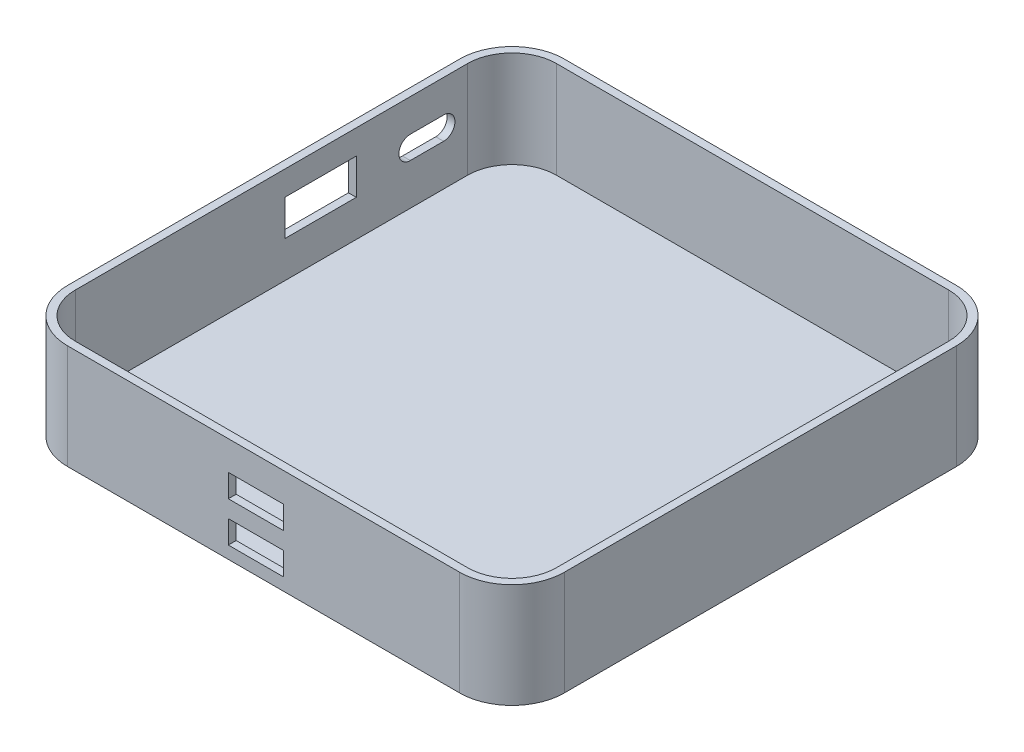
ISO-10303-21;
HEADER;
FILE_DESCRIPTION(('STEP AP214'),'2;1');
FILE_NAME('part.step','',(''),(''),'','','');
FILE_SCHEMA(('AUTOMOTIVE_DESIGN { 1 0 10303 214 1 1 1 1 }'));
ENDSEC;
DATA;
#1=APPLICATION_CONTEXT('core data for automotive mechanical design processes');
#2=APPLICATION_PROTOCOL_DEFINITION('international standard','automotive_design',2000,#1);
#3=PRODUCT_CONTEXT('',#1,'mechanical');
#4=PRODUCT('Part','Part','',(#3));
#5=PRODUCT_RELATED_PRODUCT_CATEGORY('part','',(#4));
#6=PRODUCT_DEFINITION_FORMATION('','',#4);
#7=PRODUCT_DEFINITION_CONTEXT('part definition',#1,'design');
#8=PRODUCT_DEFINITION('design','',#6,#7);
#9=PRODUCT_DEFINITION_SHAPE('','',#8);
#10=(LENGTH_UNIT() NAMED_UNIT(*) SI_UNIT(.MILLI.,.METRE.));
#11=(NAMED_UNIT(*) PLANE_ANGLE_UNIT() SI_UNIT($,.RADIAN.));
#12=(NAMED_UNIT(*) SI_UNIT($,.STERADIAN.) SOLID_ANGLE_UNIT());
#13=UNCERTAINTY_MEASURE_WITH_UNIT(LENGTH_MEASURE(1.E-05),#10,'distance_accuracy_value','');
#14=(GEOMETRIC_REPRESENTATION_CONTEXT(3) GLOBAL_UNCERTAINTY_ASSIGNED_CONTEXT((#13)) GLOBAL_UNIT_ASSIGNED_CONTEXT((#10,
#11,#12)) REPRESENTATION_CONTEXT('',''));
#15=CARTESIAN_POINT('',(0.,0.,0.));
#16=DIRECTION('',(0.,0.,1.));
#17=DIRECTION('',(1.,0.,0.));
#18=AXIS2_PLACEMENT_3D('',#15,#16,#17);
#19=CARTESIAN_POINT('',(47.5,20.,-47.5));
#20=DIRECTION('',(-1.,0.,0.));
#21=DIRECTION('',(0.,0.,1.));
#22=AXIS2_PLACEMENT_3D('',#19,#20,#21);
#23=PLANE('',#22);
#24=DIRECTION('',(0.,0.,-1.));
#25=VECTOR('',#24,1.);
#26=CARTESIAN_POINT('',(47.5,0.,-47.5));
#27=LINE('',#26,#25);
#28=CARTESIAN_POINT('',(47.5,0.,37.5));
#29=VERTEX_POINT('',#28);
#30=CARTESIAN_POINT('',(47.5,0.,-37.5));
#31=VERTEX_POINT('',#30);
#32=EDGE_CURVE('E383',#29,#31,#27,.T.);
#33=ORIENTED_EDGE('',*,*,#32,.T.);
#34=DIRECTION('',(0.,-1.,0.));
#35=VECTOR('',#34,1.);
#36=CARTESIAN_POINT('',(47.5,20.,-37.5));
#37=LINE('',#36,#35);
#38=CARTESIAN_POINT('',(47.5,20.,-37.5));
#39=VERTEX_POINT('',#38);
#40=EDGE_CURVE('E455',#31,#39,#37,.F.);
#41=ORIENTED_EDGE('',*,*,#40,.T.);
#42=DIRECTION('',(0.,0.,-1.));
#43=VECTOR('',#42,1.);
#44=CARTESIAN_POINT('',(47.5,20.,-47.5));
#45=LINE('',#44,#43);
#46=CARTESIAN_POINT('',(47.5,20.,37.5));
#47=VERTEX_POINT('',#46);
#48=EDGE_CURVE('E398',#47,#39,#45,.T.);
#49=ORIENTED_EDGE('',*,*,#48,.F.);
#50=DIRECTION('',(0.,-1.,0.));
#51=VECTOR('',#50,1.);
#52=CARTESIAN_POINT('',(47.5,20.,37.5));
#53=LINE('',#52,#51);
#54=EDGE_CURVE('E452',#47,#29,#53,.T.);
#55=ORIENTED_EDGE('',*,*,#54,.T.);
#56=EDGE_LOOP('',(#33,#41,#49,#55));
#57=FACE_BOUND('',#56,.T.);
#58=ADVANCED_FACE('F33',(#57),#23,.F.);
#59=CARTESIAN_POINT('',(-47.5,20.,-47.5));
#60=DIRECTION('',(0.,0.,1.));
#61=DIRECTION('',(1.,0.,0.));
#62=AXIS2_PLACEMENT_3D('',#59,#60,#61);
#63=PLANE('',#62);
#64=DIRECTION('',(-1.,0.,0.));
#65=VECTOR('',#64,1.);
#66=CARTESIAN_POINT('',(-47.5,0.,-47.5));
#67=LINE('',#66,#65);
#68=CARTESIAN_POINT('',(37.5,0.,-47.5));
#69=VERTEX_POINT('',#68);
#70=CARTESIAN_POINT('',(-37.5,0.,-47.5));
#71=VERTEX_POINT('',#70);
#72=EDGE_CURVE('E414',#69,#71,#67,.T.);
#73=ORIENTED_EDGE('',*,*,#72,.T.);
#74=DIRECTION('',(0.,-1.,0.));
#75=VECTOR('',#74,1.);
#76=CARTESIAN_POINT('',(-37.5,20.,-47.5));
#77=LINE('',#76,#75);
#78=CARTESIAN_POINT('',(-37.5,20.,-47.5));
#79=VERTEX_POINT('',#78);
#80=EDGE_CURVE('E437',#71,#79,#77,.F.);
#81=ORIENTED_EDGE('',*,*,#80,.T.);
#82=DIRECTION('',(-1.,0.,0.));
#83=VECTOR('',#82,1.);
#84=CARTESIAN_POINT('',(-47.5,20.,-47.5));
#85=LINE('',#84,#83);
#86=CARTESIAN_POINT('',(37.5,20.,-47.5));
#87=VERTEX_POINT('',#86);
#88=EDGE_CURVE('E401',#87,#79,#85,.T.);
#89=ORIENTED_EDGE('',*,*,#88,.F.);
#90=DIRECTION('',(0.,-1.,0.));
#91=VECTOR('',#90,1.);
#92=CARTESIAN_POINT('',(37.5,20.,-47.5));
#93=LINE('',#92,#91);
#94=EDGE_CURVE('E434',#87,#69,#93,.T.);
#95=ORIENTED_EDGE('',*,*,#94,.T.);
#96=EDGE_LOOP('',(#73,#81,#89,#95));
#97=FACE_BOUND('',#96,.T.);
#98=ADVANCED_FACE('F517',(#97),#63,.F.);
#99=CARTESIAN_POINT('',(-47.5,20.,-47.5));
#100=DIRECTION('',(1.,0.,0.));
#101=DIRECTION('',(0.,0.,-1.));
#102=AXIS2_PLACEMENT_3D('',#99,#100,#101);
#103=PLANE('',#102);
#104=DIRECTION('',(0.,0.,-1.));
#105=VECTOR('',#104,1.);
#106=CARTESIAN_POINT('',(-47.5,15.3170391811273,-16.2201304270935));
#107=LINE('',#106,#105);
#108=CARTESIAN_POINT('',(-47.5,15.3170391811273,-2.59894898769258));
#109=VERTEX_POINT('',#108);
#110=CARTESIAN_POINT('',(-47.5,15.3170391811273,-16.2201304270935));
#111=VERTEX_POINT('',#110);
#112=EDGE_CURVE('E295',#109,#111,#107,.T.);
#113=ORIENTED_EDGE('',*,*,#112,.F.);
#114=DIRECTION('',(0.,1.,0.));
#115=VECTOR('',#114,1.);
#116=CARTESIAN_POINT('',(-47.5,8.48168902621182,-2.59894898769258));
#117=LINE('',#116,#115);
#118=CARTESIAN_POINT('',(-47.5,8.48168902621182,-2.59894898769258));
#119=VERTEX_POINT('',#118);
#120=EDGE_CURVE('E273',#119,#109,#117,.T.);
#121=ORIENTED_EDGE('',*,*,#120,.F.);
#122=DIRECTION('',(0.,0.,1.));
#123=VECTOR('',#122,1.);
#124=CARTESIAN_POINT('',(-47.5,8.48168902621182,-16.2201304270935));
#125=LINE('',#124,#123);
#126=CARTESIAN_POINT('',(-47.5,8.48168902621182,-16.2201304270935));
#127=VERTEX_POINT('',#126);
#128=EDGE_CURVE('E301',#127,#119,#125,.T.);
#129=ORIENTED_EDGE('',*,*,#128,.F.);
#130=DIRECTION('',(0.,-1.,0.));
#131=VECTOR('',#130,1.);
#132=CARTESIAN_POINT('',(-47.5,8.48168902621182,-16.2201304270935));
#133=LINE('',#132,#131);
#134=EDGE_CURVE('E298',#111,#127,#133,.T.);
#135=ORIENTED_EDGE('',*,*,#134,.F.);
#136=EDGE_LOOP('',(#113,#121,#129,#135));
#137=FACE_BOUND('',#136,.T.);
#138=DIRECTION('',(0.,0.,1.));
#139=VECTOR('',#138,1.);
#140=CARTESIAN_POINT('',(-47.5,9.41378222927369,-32.917062514101));
#141=LINE('',#140,#139);
#142=CARTESIAN_POINT('',(-47.5,9.41378222927369,-32.917062514101));
#143=VERTEX_POINT('',#142);
#144=CARTESIAN_POINT('',(-47.5,9.41378222927369,-26.5458647440587));
#145=VERTEX_POINT('',#144);
#146=EDGE_CURVE('E315',#143,#145,#141,.T.);
#147=ORIENTED_EDGE('',*,*,#146,.F.);
#148=CARTESIAN_POINT('',(-47.5,11.5886663693914,-32.917062514101));
#149=DIRECTION('',(-1.,0.,0.));
#150=DIRECTION('',(0.,0.,1.));
#151=AXIS2_PLACEMENT_3D('',#148,#149,#150);
#152=CIRCLE('',#151,2.17488414011768);
#153=CARTESIAN_POINT('',(-47.5,13.7635505095091,-32.917062514101));
#154=VERTEX_POINT('',#153);
#155=EDGE_CURVE('E307',#154,#143,#152,.T.);
#156=ORIENTED_EDGE('',*,*,#155,.F.);
#157=DIRECTION('',(0.,0.,-1.));
#158=VECTOR('',#157,1.);
#159=CARTESIAN_POINT('',(-47.5,13.7635505095091,-32.917062514101));
#160=LINE('',#159,#158);
#161=CARTESIAN_POINT('',(-47.5,13.7635505095091,-26.5458647440587));
#162=VERTEX_POINT('',#161);
#163=EDGE_CURVE('E321',#162,#154,#160,.T.);
#164=ORIENTED_EDGE('',*,*,#163,.F.);
#165=CARTESIAN_POINT('',(-47.5,11.5886663693914,-26.5458647440587));
#166=DIRECTION('',(-1.,0.,0.));
#167=DIRECTION('',(0.,0.,1.));
#168=AXIS2_PLACEMENT_3D('',#165,#166,#167);
#169=CIRCLE('',#168,2.17488414011768);
#170=EDGE_CURVE('E318',#145,#162,#169,.T.);
#171=ORIENTED_EDGE('',*,*,#170,.F.);
#172=EDGE_LOOP('',(#147,#156,#164,#171));
#173=FACE_BOUND('',#172,.T.);
#174=DIRECTION('',(0.,0.,1.));
#175=VECTOR('',#174,1.);
#176=CARTESIAN_POINT('',(-47.5,20.,-47.5));
#177=LINE('',#176,#175);
#178=CARTESIAN_POINT('',(-47.5,20.,-37.5));
#179=VERTEX_POINT('',#178);
#180=CARTESIAN_POINT('',(-47.5,20.,37.5));
#181=VERTEX_POINT('',#180);
#182=EDGE_CURVE('E405',#179,#181,#177,.T.);
#183=ORIENTED_EDGE('',*,*,#182,.F.);
#184=DIRECTION('',(0.,-1.,0.));
#185=VECTOR('',#184,1.);
#186=CARTESIAN_POINT('',(-47.5,20.,-37.5));
#187=LINE('',#186,#185);
#188=CARTESIAN_POINT('',(-47.5,0.,-37.5));
#189=VERTEX_POINT('',#188);
#190=EDGE_CURVE('E423',#179,#189,#187,.T.);
#191=ORIENTED_EDGE('',*,*,#190,.T.);
#192=DIRECTION('',(0.,0.,1.));
#193=VECTOR('',#192,1.);
#194=CARTESIAN_POINT('',(-47.5,0.,-47.5));
#195=LINE('',#194,#193);
#196=CARTESIAN_POINT('',(-47.5,0.,37.5));
#197=VERTEX_POINT('',#196);
#198=EDGE_CURVE('E417',#189,#197,#195,.T.);
#199=ORIENTED_EDGE('',*,*,#198,.T.);
#200=DIRECTION('',(0.,-1.,0.));
#201=VECTOR('',#200,1.);
#202=CARTESIAN_POINT('',(-47.5,20.,37.5));
#203=LINE('',#202,#201);
#204=EDGE_CURVE('E411',#197,#181,#203,.F.);
#205=ORIENTED_EDGE('',*,*,#204,.T.);
#206=EDGE_LOOP('',(#183,#191,#199,#205));
#207=FACE_BOUND('',#206,.T.);
#208=ADVANCED_FACE('F523',(#137,#173,#207),#103,.F.);
#209=CARTESIAN_POINT('',(-47.5,20.,47.5));
#210=DIRECTION('',(0.,0.,-1.));
#211=DIRECTION('',(-1.,0.,0.));
#212=AXIS2_PLACEMENT_3D('',#209,#210,#211);
#213=PLANE('',#212);
#214=DIRECTION('',(-1.,0.,0.));
#215=VECTOR('',#214,1.);
#216=CARTESIAN_POINT('',(-6.749062627461,6.75943332918078,47.5));
#217=LINE('',#216,#215);
#218=CARTESIAN_POINT('',(3.83460728033169,6.75943332918078,47.5));
#219=VERTEX_POINT('',#218);
#220=CARTESIAN_POINT('',(-6.749062627461,6.75943332918078,47.5));
#221=VERTEX_POINT('',#220);
#222=EDGE_CURVE('E259',#219,#221,#217,.T.);
#223=ORIENTED_EDGE('',*,*,#222,.F.);
#224=DIRECTION('',(0.,1.,0.));
#225=VECTOR('',#224,1.);
#226=CARTESIAN_POINT('',(3.83460728033169,6.75943332918078,47.5));
#227=LINE('',#226,#225);
#228=CARTESIAN_POINT('',(3.83460728033169,2.37998371216312,47.5));
#229=VERTEX_POINT('',#228);
#230=EDGE_CURVE('E48',#229,#219,#227,.T.);
#231=ORIENTED_EDGE('',*,*,#230,.F.);
#232=DIRECTION('',(1.,0.,0.));
#233=VECTOR('',#232,1.);
#234=CARTESIAN_POINT('',(-6.749062627461,2.37998371216312,47.5));
#235=LINE('',#234,#233);
#236=CARTESIAN_POINT('',(-6.749062627461,2.37998371216312,47.5));
#237=VERTEX_POINT('',#236);
#238=EDGE_CURVE('E266',#237,#229,#235,.T.);
#239=ORIENTED_EDGE('',*,*,#238,.F.);
#240=DIRECTION('',(0.,-1.,0.));
#241=VECTOR('',#240,1.);
#242=CARTESIAN_POINT('',(-6.749062627461,6.75943332918078,47.5));
#243=LINE('',#242,#241);
#244=EDGE_CURVE('E249',#221,#237,#243,.T.);
#245=ORIENTED_EDGE('',*,*,#244,.F.);
#246=EDGE_LOOP('',(#223,#231,#239,#245));
#247=FACE_BOUND('',#246,.T.);
#248=DIRECTION('',(-1.,0.,0.));
#249=VECTOR('',#248,1.);
#250=CARTESIAN_POINT('',(-6.749062627461,14.4234701589617,47.5));
#251=LINE('',#250,#249);
#252=CARTESIAN_POINT('',(3.83460728033169,14.4234701589617,47.5));
#253=VERTEX_POINT('',#252);
#254=CARTESIAN_POINT('',(-6.749062627461,14.4234701589617,47.5));
#255=VERTEX_POINT('',#254);
#256=EDGE_CURVE('E277',#253,#255,#251,.T.);
#257=ORIENTED_EDGE('',*,*,#256,.F.);
#258=DIRECTION('',(0.,1.,0.));
#259=VECTOR('',#258,1.);
#260=CARTESIAN_POINT('',(3.83460728033169,10.044020541944,47.5));
#261=LINE('',#260,#259);
#262=CARTESIAN_POINT('',(3.83460728033169,10.044020541944,47.5));
#263=VERTEX_POINT('',#262);
#264=EDGE_CURVE('E56',#263,#253,#261,.T.);
#265=ORIENTED_EDGE('',*,*,#264,.F.);
#266=DIRECTION('',(1.,0.,0.));
#267=VECTOR('',#266,1.);
#268=CARTESIAN_POINT('',(-6.749062627461,10.044020541944,47.5));
#269=LINE('',#268,#267);
#270=CARTESIAN_POINT('',(-6.749062627461,10.044020541944,47.5));
#271=VERTEX_POINT('',#270);
#272=EDGE_CURVE('E283',#271,#263,#269,.T.);
#273=ORIENTED_EDGE('',*,*,#272,.F.);
#274=DIRECTION('',(0.,-1.,0.));
#275=VECTOR('',#274,1.);
#276=CARTESIAN_POINT('',(-6.749062627461,10.044020541944,47.5));
#277=LINE('',#276,#275);
#278=EDGE_CURVE('E280',#255,#271,#277,.T.);
#279=ORIENTED_EDGE('',*,*,#278,.F.);
#280=EDGE_LOOP('',(#257,#265,#273,#279));
#281=FACE_BOUND('',#280,.T.);
#282=DIRECTION('',(1.,0.,0.));
#283=VECTOR('',#282,1.);
#284=CARTESIAN_POINT('',(-47.5,20.,47.5));
#285=LINE('',#284,#283);
#286=CARTESIAN_POINT('',(-37.5,20.,47.5));
#287=VERTEX_POINT('',#286);
#288=CARTESIAN_POINT('',(37.5,20.,47.5));
#289=VERTEX_POINT('',#288);
#290=EDGE_CURVE('E408',#287,#289,#285,.T.);
#291=ORIENTED_EDGE('',*,*,#290,.F.);
#292=DIRECTION('',(0.,-1.,0.));
#293=VECTOR('',#292,1.);
#294=CARTESIAN_POINT('',(-37.5,20.,47.5));
#295=LINE('',#294,#293);
#296=CARTESIAN_POINT('',(-37.5,0.,47.5));
#297=VERTEX_POINT('',#296);
#298=EDGE_CURVE('E449',#287,#297,#295,.T.);
#299=ORIENTED_EDGE('',*,*,#298,.T.);
#300=DIRECTION('',(1.,0.,0.));
#301=VECTOR('',#300,1.);
#302=CARTESIAN_POINT('',(-47.5,0.,47.5));
#303=LINE('',#302,#301);
#304=CARTESIAN_POINT('',(37.5,0.,47.5));
#305=VERTEX_POINT('',#304);
#306=EDGE_CURVE('E402',#297,#305,#303,.T.);
#307=ORIENTED_EDGE('',*,*,#306,.T.);
#308=DIRECTION('',(0.,-1.,0.));
#309=VECTOR('',#308,1.);
#310=CARTESIAN_POINT('',(37.5,20.,47.5));
#311=LINE('',#310,#309);
#312=EDGE_CURVE('E447',#305,#289,#311,.F.);
#313=ORIENTED_EDGE('',*,*,#312,.T.);
#314=EDGE_LOOP('',(#291,#299,#307,#313));
#315=FACE_BOUND('',#314,.T.);
#316=ADVANCED_FACE('F263',(#247,#281,#315),#213,.F.);
#317=CARTESIAN_POINT('',(0.,20.,0.));
#318=DIRECTION('',(0.,1.,0.));
#319=DIRECTION('',(0.,0.,1.));
#320=AXIS2_PLACEMENT_3D('',#317,#318,#319);
#321=PLANE('',#320);
#322=CARTESIAN_POINT('',(37.5,20.,-37.5));
#323=DIRECTION('',(0.,1.,0.));
#324=DIRECTION('',(0.,0.,1.));
#325=AXIS2_PLACEMENT_3D('',#322,#323,#324);
#326=CIRCLE('',#325,8.5);
#327=CARTESIAN_POINT('',(46.,20.,-37.5));
#328=VERTEX_POINT('',#327);
#329=CARTESIAN_POINT('',(37.5,20.,-46.));
#330=VERTEX_POINT('',#329);
#331=EDGE_CURVE('E327',#328,#330,#326,.T.);
#332=ORIENTED_EDGE('',*,*,#331,.F.);
#333=DIRECTION('',(0.,0.,-1.));
#334=VECTOR('',#333,1.);
#335=CARTESIAN_POINT('',(46.,20.,37.5));
#336=LINE('',#335,#334);
#337=CARTESIAN_POINT('',(46.,20.,37.5));
#338=VERTEX_POINT('',#337);
#339=EDGE_CURVE('E338',#338,#328,#336,.T.);
#340=ORIENTED_EDGE('',*,*,#339,.F.);
#341=CARTESIAN_POINT('',(37.5,20.,37.5));
#342=DIRECTION('',(0.,1.,0.));
#343=DIRECTION('',(0.,0.,1.));
#344=AXIS2_PLACEMENT_3D('',#341,#342,#343);
#345=CIRCLE('',#344,8.5);
#346=CARTESIAN_POINT('',(37.5,20.,46.));
#347=VERTEX_POINT('',#346);
#348=EDGE_CURVE('E376',#347,#338,#345,.T.);
#349=ORIENTED_EDGE('',*,*,#348,.F.);
#350=DIRECTION('',(1.,0.,0.));
#351=VECTOR('',#350,1.);
#352=CARTESIAN_POINT('',(-37.5,20.,46.));
#353=LINE('',#352,#351);
#354=CARTESIAN_POINT('',(-37.5,20.,46.));
#355=VERTEX_POINT('',#354);
#356=EDGE_CURVE('E373',#355,#347,#353,.T.);
#357=ORIENTED_EDGE('',*,*,#356,.F.);
#358=CARTESIAN_POINT('',(-37.5,20.,37.5));
#359=DIRECTION('',(0.,1.,0.));
#360=DIRECTION('',(0.,0.,1.));
#361=AXIS2_PLACEMENT_3D('',#358,#359,#360);
#362=CIRCLE('',#361,8.5);
#363=CARTESIAN_POINT('',(-46.,20.,37.5));
#364=VERTEX_POINT('',#363);
#365=EDGE_CURVE('E370',#364,#355,#362,.T.);
#366=ORIENTED_EDGE('',*,*,#365,.F.);
#367=DIRECTION('',(0.,0.,1.));
#368=VECTOR('',#367,1.);
#369=CARTESIAN_POINT('',(-46.,20.,-37.5));
#370=LINE('',#369,#368);
#371=CARTESIAN_POINT('',(-46.,20.,-37.5));
#372=VERTEX_POINT('',#371);
#373=EDGE_CURVE('E367',#372,#364,#370,.T.);
#374=ORIENTED_EDGE('',*,*,#373,.F.);
#375=CARTESIAN_POINT('',(-37.5,20.,-37.5));
#376=DIRECTION('',(0.,1.,0.));
#377=DIRECTION('',(0.,0.,1.));
#378=AXIS2_PLACEMENT_3D('',#375,#376,#377);
#379=CIRCLE('',#378,8.5);
#380=CARTESIAN_POINT('',(-37.5,20.,-46.));
#381=VERTEX_POINT('',#380);
#382=EDGE_CURVE('E364',#381,#372,#379,.T.);
#383=ORIENTED_EDGE('',*,*,#382,.F.);
#384=DIRECTION('',(-1.,0.,0.));
#385=VECTOR('',#384,1.);
#386=CARTESIAN_POINT('',(37.5,20.,-46.));
#387=LINE('',#386,#385);
#388=EDGE_CURVE('E361',#330,#381,#387,.T.);
#389=ORIENTED_EDGE('',*,*,#388,.F.);
#390=EDGE_LOOP('',(#332,#340,#349,#357,#366,#374,#383,#389));
#391=FACE_BOUND('',#390,.T.);
#392=ORIENTED_EDGE('',*,*,#88,.T.);
#393=CARTESIAN_POINT('',(-37.5,20.,-37.5));
#394=DIRECTION('',(0.,1.,0.));
#395=DIRECTION('',(0.,0.,1.));
#396=AXIS2_PLACEMENT_3D('',#393,#394,#395);
#397=CIRCLE('',#396,10.);
#398=EDGE_CURVE('E445',#79,#179,#397,.T.);
#399=ORIENTED_EDGE('',*,*,#398,.T.);
#400=ORIENTED_EDGE('',*,*,#182,.T.);
#401=CARTESIAN_POINT('',(-37.5,20.,37.5));
#402=DIRECTION('',(0.,1.,0.));
#403=DIRECTION('',(0.,0.,1.));
#404=AXIS2_PLACEMENT_3D('',#401,#402,#403);
#405=CIRCLE('',#404,10.);
#406=EDGE_CURVE('E443',#181,#287,#405,.T.);
#407=ORIENTED_EDGE('',*,*,#406,.T.);
#408=ORIENTED_EDGE('',*,*,#290,.T.);
#409=CARTESIAN_POINT('',(37.5,20.,37.5));
#410=DIRECTION('',(0.,1.,0.));
#411=DIRECTION('',(0.,0.,1.));
#412=AXIS2_PLACEMENT_3D('',#409,#410,#411);
#413=CIRCLE('',#412,10.);
#414=EDGE_CURVE('E439',#289,#47,#413,.T.);
#415=ORIENTED_EDGE('',*,*,#414,.T.);
#416=ORIENTED_EDGE('',*,*,#48,.T.);
#417=CARTESIAN_POINT('',(37.5,20.,-37.5));
#418=DIRECTION('',(0.,1.,0.));
#419=DIRECTION('',(0.,0.,1.));
#420=AXIS2_PLACEMENT_3D('',#417,#418,#419);
#421=CIRCLE('',#420,10.);
#422=EDGE_CURVE('E441',#39,#87,#421,.T.);
#423=ORIENTED_EDGE('',*,*,#422,.T.);
#424=EDGE_LOOP('',(#392,#399,#400,#407,#408,#415,#416,#423));
#425=FACE_BOUND('',#424,.T.);
#426=ADVANCED_FACE('F549',(#391,#425),#321,.T.);
#427=CARTESIAN_POINT('',(0.,0.,0.));
#428=DIRECTION('',(0.,1.,0.));
#429=DIRECTION('',(0.,0.,1.));
#430=AXIS2_PLACEMENT_3D('',#427,#428,#429);
#431=PLANE('',#430);
#432=ORIENTED_EDGE('',*,*,#198,.F.);
#433=CARTESIAN_POINT('',(-37.5,0.,-37.5));
#434=DIRECTION('',(0.,1.,0.));
#435=DIRECTION('',(0.,0.,1.));
#436=AXIS2_PLACEMENT_3D('',#433,#434,#435);
#437=CIRCLE('',#436,10.);
#438=EDGE_CURVE('E432',#189,#71,#437,.F.);
#439=ORIENTED_EDGE('',*,*,#438,.T.);
#440=ORIENTED_EDGE('',*,*,#72,.F.);
#441=CARTESIAN_POINT('',(37.5,0.,-37.5));
#442=DIRECTION('',(0.,1.,0.));
#443=DIRECTION('',(0.,0.,1.));
#444=AXIS2_PLACEMENT_3D('',#441,#442,#443);
#445=CIRCLE('',#444,10.);
#446=EDGE_CURVE('E428',#69,#31,#445,.F.);
#447=ORIENTED_EDGE('',*,*,#446,.T.);
#448=ORIENTED_EDGE('',*,*,#32,.F.);
#449=CARTESIAN_POINT('',(37.5,0.,37.5));
#450=DIRECTION('',(0.,1.,0.));
#451=DIRECTION('',(0.,0.,1.));
#452=AXIS2_PLACEMENT_3D('',#449,#450,#451);
#453=CIRCLE('',#452,10.);
#454=EDGE_CURVE('E426',#29,#305,#453,.F.);
#455=ORIENTED_EDGE('',*,*,#454,.T.);
#456=ORIENTED_EDGE('',*,*,#306,.F.);
#457=CARTESIAN_POINT('',(-37.5,0.,37.5));
#458=DIRECTION('',(0.,1.,0.));
#459=DIRECTION('',(0.,0.,1.));
#460=AXIS2_PLACEMENT_3D('',#457,#458,#459);
#461=CIRCLE('',#460,10.);
#462=EDGE_CURVE('E430',#297,#197,#461,.F.);
#463=ORIENTED_EDGE('',*,*,#462,.T.);
#464=EDGE_LOOP('',(#432,#439,#440,#447,#448,#455,#456,#463));
#465=FACE_BOUND('',#464,.T.);
#466=ADVANCED_FACE('F532',(#465),#431,.F.);
#467=CARTESIAN_POINT('',(-37.5,20.,-37.5));
#468=DIRECTION('',(0.,-1.,0.));
#469=DIRECTION('',(0.,0.,-1.));
#470=AXIS2_PLACEMENT_3D('',#467,#468,#469);
#471=CYLINDRICAL_SURFACE('',#470,10.);
#472=ORIENTED_EDGE('',*,*,#398,.F.);
#473=ORIENTED_EDGE('',*,*,#80,.F.);
#474=ORIENTED_EDGE('',*,*,#438,.F.);
#475=ORIENTED_EDGE('',*,*,#190,.F.);
#476=EDGE_LOOP('',(#472,#473,#474,#475));
#477=FACE_BOUND('',#476,.T.);
#478=ADVANCED_FACE('F528',(#477),#471,.T.);
#479=CARTESIAN_POINT('',(-37.5,20.,37.5));
#480=DIRECTION('',(0.,-1.,0.));
#481=DIRECTION('',(0.,0.,-1.));
#482=AXIS2_PLACEMENT_3D('',#479,#480,#481);
#483=CYLINDRICAL_SURFACE('',#482,10.);
#484=ORIENTED_EDGE('',*,*,#406,.F.);
#485=ORIENTED_EDGE('',*,*,#204,.F.);
#486=ORIENTED_EDGE('',*,*,#462,.F.);
#487=ORIENTED_EDGE('',*,*,#298,.F.);
#488=EDGE_LOOP('',(#484,#485,#486,#487));
#489=FACE_BOUND('',#488,.T.);
#490=ADVANCED_FACE('F531',(#489),#483,.T.);
#491=CARTESIAN_POINT('',(37.5,20.,-37.5));
#492=DIRECTION('',(0.,-1.,0.));
#493=DIRECTION('',(0.,0.,-1.));
#494=AXIS2_PLACEMENT_3D('',#491,#492,#493);
#495=CYLINDRICAL_SURFACE('',#494,10.);
#496=ORIENTED_EDGE('',*,*,#422,.F.);
#497=ORIENTED_EDGE('',*,*,#40,.F.);
#498=ORIENTED_EDGE('',*,*,#446,.F.);
#499=ORIENTED_EDGE('',*,*,#94,.F.);
#500=EDGE_LOOP('',(#496,#497,#498,#499));
#501=FACE_BOUND('',#500,.T.);
#502=ADVANCED_FACE('F535',(#501),#495,.T.);
#503=CARTESIAN_POINT('',(37.5,20.,37.5));
#504=DIRECTION('',(0.,-1.,0.));
#505=DIRECTION('',(0.,0.,-1.));
#506=AXIS2_PLACEMENT_3D('',#503,#504,#505);
#507=CYLINDRICAL_SURFACE('',#506,10.);
#508=ORIENTED_EDGE('',*,*,#414,.F.);
#509=ORIENTED_EDGE('',*,*,#312,.F.);
#510=ORIENTED_EDGE('',*,*,#454,.F.);
#511=ORIENTED_EDGE('',*,*,#54,.F.);
#512=EDGE_LOOP('',(#508,#509,#510,#511));
#513=FACE_BOUND('',#512,.T.);
#514=ADVANCED_FACE('F35',(#513),#507,.T.);
#515=CARTESIAN_POINT('',(37.5,1.5,-37.5));
#516=DIRECTION('',(0.,1.,0.));
#517=DIRECTION('',(0.,0.,1.));
#518=AXIS2_PLACEMENT_3D('',#515,#516,#517);
#519=CYLINDRICAL_SURFACE('',#518,8.5);
#520=ORIENTED_EDGE('',*,*,#331,.T.);
#521=DIRECTION('',(0.,1.,0.));
#522=VECTOR('',#521,1.);
#523=CARTESIAN_POINT('',(37.5,1.5,-46.));
#524=LINE('',#523,#522);
#525=CARTESIAN_POINT('',(37.5,1.5,-46.));
#526=VERTEX_POINT('',#525);
#527=EDGE_CURVE('E359',#526,#330,#524,.T.);
#528=ORIENTED_EDGE('',*,*,#527,.F.);
#529=CARTESIAN_POINT('',(37.5,1.5,-37.5));
#530=DIRECTION('',(0.,1.,0.));
#531=DIRECTION('',(0.,0.,1.));
#532=AXIS2_PLACEMENT_3D('',#529,#530,#531);
#533=CIRCLE('',#532,8.5);
#534=CARTESIAN_POINT('',(46.,1.5,-37.5));
#535=VERTEX_POINT('',#534);
#536=EDGE_CURVE('E334',#535,#526,#533,.T.);
#537=ORIENTED_EDGE('',*,*,#536,.F.);
#538=DIRECTION('',(0.,1.,0.));
#539=VECTOR('',#538,1.);
#540=CARTESIAN_POINT('',(46.,1.5,-37.5));
#541=LINE('',#540,#539);
#542=EDGE_CURVE('E381',#535,#328,#541,.T.);
#543=ORIENTED_EDGE('',*,*,#542,.T.);
#544=EDGE_LOOP('',(#520,#528,#537,#543));
#545=FACE_BOUND('',#544,.T.);
#546=ADVANCED_FACE('F542',(#545),#519,.F.);
#547=CARTESIAN_POINT('',(46.,1.5,37.5));
#548=DIRECTION('',(1.,0.,0.));
#549=DIRECTION('',(0.,0.,-1.));
#550=AXIS2_PLACEMENT_3D('',#547,#548,#549);
#551=PLANE('',#550);
#552=ORIENTED_EDGE('',*,*,#339,.T.);
#553=ORIENTED_EDGE('',*,*,#542,.F.);
#554=DIRECTION('',(0.,0.,-1.));
#555=VECTOR('',#554,1.);
#556=CARTESIAN_POINT('',(46.,1.5,37.5));
#557=LINE('',#556,#555);
#558=CARTESIAN_POINT('',(46.,1.5,37.5));
#559=VERTEX_POINT('',#558);
#560=EDGE_CURVE('E356',#559,#535,#557,.T.);
#561=ORIENTED_EDGE('',*,*,#560,.F.);
#562=DIRECTION('',(0.,1.,0.));
#563=VECTOR('',#562,1.);
#564=CARTESIAN_POINT('',(46.,1.5,37.5));
#565=LINE('',#564,#563);
#566=EDGE_CURVE('E384',#559,#338,#565,.T.);
#567=ORIENTED_EDGE('',*,*,#566,.T.);
#568=EDGE_LOOP('',(#552,#553,#561,#567));
#569=FACE_BOUND('',#568,.T.);
#570=ADVANCED_FACE('F626',(#569),#551,.F.);
#571=CARTESIAN_POINT('',(37.5,1.5,37.5));
#572=DIRECTION('',(0.,1.,0.));
#573=DIRECTION('',(0.,0.,1.));
#574=AXIS2_PLACEMENT_3D('',#571,#572,#573);
#575=CYLINDRICAL_SURFACE('',#574,8.5);
#576=ORIENTED_EDGE('',*,*,#348,.T.);
#577=ORIENTED_EDGE('',*,*,#566,.F.);
#578=CARTESIAN_POINT('',(37.5,1.5,37.5));
#579=DIRECTION('',(0.,1.,0.));
#580=DIRECTION('',(0.,0.,1.));
#581=AXIS2_PLACEMENT_3D('',#578,#579,#580);
#582=CIRCLE('',#581,8.5);
#583=CARTESIAN_POINT('',(37.5,1.5,46.));
#584=VERTEX_POINT('',#583);
#585=EDGE_CURVE('E353',#584,#559,#582,.T.);
#586=ORIENTED_EDGE('',*,*,#585,.F.);
#587=DIRECTION('',(0.,1.,0.));
#588=VECTOR('',#587,1.);
#589=CARTESIAN_POINT('',(37.5,1.5,46.));
#590=LINE('',#589,#588);
#591=EDGE_CURVE('E386',#584,#347,#590,.T.);
#592=ORIENTED_EDGE('',*,*,#591,.T.);
#593=EDGE_LOOP('',(#576,#577,#586,#592));
#594=FACE_BOUND('',#593,.T.);
#595=ADVANCED_FACE('F629',(#594),#575,.F.);
#596=CARTESIAN_POINT('',(-37.5,1.5,46.));
#597=DIRECTION('',(0.,0.,1.));
#598=DIRECTION('',(1.,0.,0.));
#599=AXIS2_PLACEMENT_3D('',#596,#597,#598);
#600=PLANE('',#599);
#601=DIRECTION('',(1.,0.,0.));
#602=VECTOR('',#601,1.);
#603=CARTESIAN_POINT('',(-37.5,2.37998371216312,46.));
#604=LINE('',#603,#602);
#605=CARTESIAN_POINT('',(-6.749062627461,2.37998371216312,46.));
#606=VERTEX_POINT('',#605);
#607=CARTESIAN_POINT('',(3.83460728033169,2.37998371216312,46.));
#608=VERTEX_POINT('',#607);
#609=EDGE_CURVE('E41',#606,#608,#604,.T.);
#610=ORIENTED_EDGE('',*,*,#609,.T.);
#611=DIRECTION('',(0.,1.,0.));
#612=VECTOR('',#611,1.);
#613=CARTESIAN_POINT('',(3.83460728033169,1.5,46.));
#614=LINE('',#613,#612);
#615=CARTESIAN_POINT('',(3.83460728033169,6.75943332918078,46.));
#616=VERTEX_POINT('',#615);
#617=EDGE_CURVE('E11',#608,#616,#614,.T.);
#618=ORIENTED_EDGE('',*,*,#617,.T.);
#619=DIRECTION('',(-1.,0.,0.));
#620=VECTOR('',#619,1.);
#621=CARTESIAN_POINT('',(-37.5,6.75943332918078,46.));
#622=LINE('',#621,#620);
#623=CARTESIAN_POINT('',(-6.749062627461,6.75943332918078,46.));
#624=VERTEX_POINT('',#623);
#625=EDGE_CURVE('E493',#616,#624,#622,.T.);
#626=ORIENTED_EDGE('',*,*,#625,.T.);
#627=DIRECTION('',(0.,-1.,0.));
#628=VECTOR('',#627,1.);
#629=CARTESIAN_POINT('',(-6.749062627461,1.5,46.));
#630=LINE('',#629,#628);
#631=EDGE_CURVE('E252',#624,#606,#630,.T.);
#632=ORIENTED_EDGE('',*,*,#631,.T.);
#633=EDGE_LOOP('',(#610,#618,#626,#632));
#634=FACE_BOUND('',#633,.T.);
#635=DIRECTION('',(1.,0.,0.));
#636=VECTOR('',#635,1.);
#637=CARTESIAN_POINT('',(-37.5,10.044020541944,46.));
#638=LINE('',#637,#636);
#639=CARTESIAN_POINT('',(-6.749062627461,10.044020541944,46.));
#640=VERTEX_POINT('',#639);
#641=CARTESIAN_POINT('',(3.83460728033169,10.044020541944,46.));
#642=VERTEX_POINT('',#641);
#643=EDGE_CURVE('E487',#640,#642,#638,.T.);
#644=ORIENTED_EDGE('',*,*,#643,.T.);
#645=DIRECTION('',(0.,1.,0.));
#646=VECTOR('',#645,1.);
#647=CARTESIAN_POINT('',(3.83460728033169,1.5,46.));
#648=LINE('',#647,#646);
#649=CARTESIAN_POINT('',(3.83460728033169,14.4234701589617,46.));
#650=VERTEX_POINT('',#649);
#651=EDGE_CURVE('E490',#642,#650,#648,.T.);
#652=ORIENTED_EDGE('',*,*,#651,.T.);
#653=DIRECTION('',(-1.,0.,0.));
#654=VECTOR('',#653,1.);
#655=CARTESIAN_POINT('',(-37.5,14.4234701589617,46.));
#656=LINE('',#655,#654);
#657=CARTESIAN_POINT('',(-6.749062627461,14.4234701589617,46.));
#658=VERTEX_POINT('',#657);
#659=EDGE_CURVE('E481',#650,#658,#656,.T.);
#660=ORIENTED_EDGE('',*,*,#659,.T.);
#661=DIRECTION('',(0.,-1.,0.));
#662=VECTOR('',#661,1.);
#663=CARTESIAN_POINT('',(-6.749062627461,1.5,46.));
#664=LINE('',#663,#662);
#665=EDGE_CURVE('E484',#658,#640,#664,.T.);
#666=ORIENTED_EDGE('',*,*,#665,.T.);
#667=EDGE_LOOP('',(#644,#652,#660,#666));
#668=FACE_BOUND('',#667,.T.);
#669=ORIENTED_EDGE('',*,*,#356,.T.);
#670=ORIENTED_EDGE('',*,*,#591,.F.);
#671=DIRECTION('',(1.,0.,0.));
#672=VECTOR('',#671,1.);
#673=CARTESIAN_POINT('',(-37.5,1.5,46.));
#674=LINE('',#673,#672);
#675=CARTESIAN_POINT('',(-37.5,1.5,46.));
#676=VERTEX_POINT('',#675);
#677=EDGE_CURVE('E350',#676,#584,#674,.T.);
#678=ORIENTED_EDGE('',*,*,#677,.F.);
#679=DIRECTION('',(0.,1.,0.));
#680=VECTOR('',#679,1.);
#681=CARTESIAN_POINT('',(-37.5,1.5,46.));
#682=LINE('',#681,#680);
#683=EDGE_CURVE('E388',#676,#355,#682,.T.);
#684=ORIENTED_EDGE('',*,*,#683,.T.);
#685=EDGE_LOOP('',(#669,#670,#678,#684));
#686=FACE_BOUND('',#685,.T.);
#687=ADVANCED_FACE('F497',(#634,#668,#686),#600,.F.);
#688=CARTESIAN_POINT('',(-37.5,1.5,37.5));
#689=DIRECTION('',(0.,1.,0.));
#690=DIRECTION('',(0.,0.,1.));
#691=AXIS2_PLACEMENT_3D('',#688,#689,#690);
#692=CYLINDRICAL_SURFACE('',#691,8.5);
#693=ORIENTED_EDGE('',*,*,#365,.T.);
#694=ORIENTED_EDGE('',*,*,#683,.F.);
#695=CARTESIAN_POINT('',(-37.5,1.5,37.5));
#696=DIRECTION('',(0.,1.,0.));
#697=DIRECTION('',(0.,0.,1.));
#698=AXIS2_PLACEMENT_3D('',#695,#696,#697);
#699=CIRCLE('',#698,8.5);
#700=CARTESIAN_POINT('',(-46.,1.5,37.5));
#701=VERTEX_POINT('',#700);
#702=EDGE_CURVE('E347',#701,#676,#699,.T.);
#703=ORIENTED_EDGE('',*,*,#702,.F.);
#704=DIRECTION('',(0.,1.,0.));
#705=VECTOR('',#704,1.);
#706=CARTESIAN_POINT('',(-46.,1.5,37.5));
#707=LINE('',#706,#705);
#708=EDGE_CURVE('E390',#701,#364,#707,.T.);
#709=ORIENTED_EDGE('',*,*,#708,.T.);
#710=EDGE_LOOP('',(#693,#694,#703,#709));
#711=FACE_BOUND('',#710,.T.);
#712=ADVANCED_FACE('F636',(#711),#692,.F.);
#713=CARTESIAN_POINT('',(-46.,1.5,-37.5));
#714=DIRECTION('',(-1.,0.,0.));
#715=DIRECTION('',(0.,0.,1.));
#716=AXIS2_PLACEMENT_3D('',#713,#714,#715);
#717=PLANE('',#716);
#718=DIRECTION('',(0.,0.,1.));
#719=VECTOR('',#718,1.);
#720=CARTESIAN_POINT('',(-46.,8.48168902621182,-37.5));
#721=LINE('',#720,#719);
#722=CARTESIAN_POINT('',(-46.,8.48168902621182,-16.2201304270935));
#723=VERTEX_POINT('',#722);
#724=CARTESIAN_POINT('',(-46.,8.48168902621182,-2.59894898769258));
#725=VERTEX_POINT('',#724);
#726=EDGE_CURVE('E475',#723,#725,#721,.T.);
#727=ORIENTED_EDGE('',*,*,#726,.T.);
#728=DIRECTION('',(0.,1.,0.));
#729=VECTOR('',#728,1.);
#730=CARTESIAN_POINT('',(-46.,1.5,-2.59894898769258));
#731=LINE('',#730,#729);
#732=CARTESIAN_POINT('',(-46.,15.3170391811273,-2.59894898769258));
#733=VERTEX_POINT('',#732);
#734=EDGE_CURVE('E478',#725,#733,#731,.T.);
#735=ORIENTED_EDGE('',*,*,#734,.T.);
#736=DIRECTION('',(0.,0.,-1.));
#737=VECTOR('',#736,1.);
#738=CARTESIAN_POINT('',(-46.,15.3170391811273,-37.5));
#739=LINE('',#738,#737);
#740=CARTESIAN_POINT('',(-46.,15.3170391811273,-16.2201304270935));
#741=VERTEX_POINT('',#740);
#742=EDGE_CURVE('E469',#733,#741,#739,.T.);
#743=ORIENTED_EDGE('',*,*,#742,.T.);
#744=DIRECTION('',(0.,-1.,0.));
#745=VECTOR('',#744,1.);
#746=CARTESIAN_POINT('',(-46.,1.5,-16.2201304270935));
#747=LINE('',#746,#745);
#748=EDGE_CURVE('E472',#741,#723,#747,.T.);
#749=ORIENTED_EDGE('',*,*,#748,.T.);
#750=EDGE_LOOP('',(#727,#735,#743,#749));
#751=FACE_BOUND('',#750,.T.);
#752=DIRECTION('',(0.,0.,-1.));
#753=VECTOR('',#752,1.);
#754=CARTESIAN_POINT('',(-46.,13.7635505095091,-37.5));
#755=LINE('',#754,#753);
#756=CARTESIAN_POINT('',(-46.,13.7635505095091,-26.5458647440587));
#757=VERTEX_POINT('',#756);
#758=CARTESIAN_POINT('',(-46.,13.7635505095091,-32.917062514101));
#759=VERTEX_POINT('',#758);
#760=EDGE_CURVE('E463',#757,#759,#755,.T.);
#761=ORIENTED_EDGE('',*,*,#760,.T.);
#762=CARTESIAN_POINT('',(-46.,11.5886663693914,-32.917062514101));
#763=DIRECTION('',(-1.,0.,0.));
#764=DIRECTION('',(0.,0.,1.));
#765=AXIS2_PLACEMENT_3D('',#762,#763,#764);
#766=CIRCLE('',#765,2.17488414011768);
#767=CARTESIAN_POINT('',(-46.,9.41378222927369,-32.917062514101));
#768=VERTEX_POINT('',#767);
#769=EDGE_CURVE('E466',#759,#768,#766,.T.);
#770=ORIENTED_EDGE('',*,*,#769,.T.);
#771=DIRECTION('',(0.,0.,1.));
#772=VECTOR('',#771,1.);
#773=CARTESIAN_POINT('',(-46.,9.41378222927369,-37.5));
#774=LINE('',#773,#772);
#775=CARTESIAN_POINT('',(-46.,9.41378222927369,-26.5458647440587));
#776=VERTEX_POINT('',#775);
#777=EDGE_CURVE('E457',#768,#776,#774,.T.);
#778=ORIENTED_EDGE('',*,*,#777,.T.);
#779=CARTESIAN_POINT('',(-46.,11.5886663693914,-26.5458647440587));
#780=DIRECTION('',(-1.,0.,0.));
#781=DIRECTION('',(0.,0.,1.));
#782=AXIS2_PLACEMENT_3D('',#779,#780,#781);
#783=CIRCLE('',#782,2.17488414011768);
#784=EDGE_CURVE('E460',#776,#757,#783,.T.);
#785=ORIENTED_EDGE('',*,*,#784,.T.);
#786=EDGE_LOOP('',(#761,#770,#778,#785));
#787=FACE_BOUND('',#786,.T.);
#788=ORIENTED_EDGE('',*,*,#373,.T.);
#789=ORIENTED_EDGE('',*,*,#708,.F.);
#790=DIRECTION('',(0.,0.,1.));
#791=VECTOR('',#790,1.);
#792=CARTESIAN_POINT('',(-46.,1.5,-37.5));
#793=LINE('',#792,#791);
#794=CARTESIAN_POINT('',(-46.,1.5,-37.5));
#795=VERTEX_POINT('',#794);
#796=EDGE_CURVE('E344',#795,#701,#793,.T.);
#797=ORIENTED_EDGE('',*,*,#796,.F.);
#798=DIRECTION('',(0.,1.,0.));
#799=VECTOR('',#798,1.);
#800=CARTESIAN_POINT('',(-46.,1.5,-37.5));
#801=LINE('',#800,#799);
#802=EDGE_CURVE('E392',#795,#372,#801,.T.);
#803=ORIENTED_EDGE('',*,*,#802,.T.);
#804=EDGE_LOOP('',(#788,#789,#797,#803));
#805=FACE_BOUND('',#804,.T.);
#806=ADVANCED_FACE('F601',(#751,#787,#805),#717,.F.);
#807=CARTESIAN_POINT('',(-37.5,1.5,-37.5));
#808=DIRECTION('',(0.,1.,0.));
#809=DIRECTION('',(0.,0.,1.));
#810=AXIS2_PLACEMENT_3D('',#807,#808,#809);
#811=CYLINDRICAL_SURFACE('',#810,8.5);
#812=ORIENTED_EDGE('',*,*,#382,.T.);
#813=ORIENTED_EDGE('',*,*,#802,.F.);
#814=CARTESIAN_POINT('',(-37.5,1.5,-37.5));
#815=DIRECTION('',(0.,1.,0.));
#816=DIRECTION('',(0.,0.,1.));
#817=AXIS2_PLACEMENT_3D('',#814,#815,#816);
#818=CIRCLE('',#817,8.5);
#819=CARTESIAN_POINT('',(-37.5,1.5,-46.));
#820=VERTEX_POINT('',#819);
#821=EDGE_CURVE('E341',#820,#795,#818,.T.);
#822=ORIENTED_EDGE('',*,*,#821,.F.);
#823=DIRECTION('',(0.,1.,0.));
#824=VECTOR('',#823,1.);
#825=CARTESIAN_POINT('',(-37.5,1.5,-46.));
#826=LINE('',#825,#824);
#827=EDGE_CURVE('E394',#820,#381,#826,.T.);
#828=ORIENTED_EDGE('',*,*,#827,.T.);
#829=EDGE_LOOP('',(#812,#813,#822,#828));
#830=FACE_BOUND('',#829,.T.);
#831=ADVANCED_FACE('F641',(#830),#811,.F.);
#832=CARTESIAN_POINT('',(37.5,1.5,-46.));
#833=DIRECTION('',(0.,0.,-1.));
#834=DIRECTION('',(-1.,0.,0.));
#835=AXIS2_PLACEMENT_3D('',#832,#833,#834);
#836=PLANE('',#835);
#837=ORIENTED_EDGE('',*,*,#388,.T.);
#838=ORIENTED_EDGE('',*,*,#827,.F.);
#839=DIRECTION('',(-1.,0.,0.));
#840=VECTOR('',#839,1.);
#841=CARTESIAN_POINT('',(37.5,1.5,-46.));
#842=LINE('',#841,#840);
#843=EDGE_CURVE('E337',#526,#820,#842,.T.);
#844=ORIENTED_EDGE('',*,*,#843,.F.);
#845=ORIENTED_EDGE('',*,*,#527,.T.);
#846=EDGE_LOOP('',(#837,#838,#844,#845));
#847=FACE_BOUND('',#846,.T.);
#848=ADVANCED_FACE('F624',(#847),#836,.F.);
#849=CARTESIAN_POINT('',(37.5,1.5,-37.5));
#850=DIRECTION('',(0.,1.,0.));
#851=DIRECTION('',(0.,0.,1.));
#852=AXIS2_PLACEMENT_3D('',#849,#850,#851);
#853=PLANE('',#852);
#854=ORIENTED_EDGE('',*,*,#536,.T.);
#855=ORIENTED_EDGE('',*,*,#843,.T.);
#856=ORIENTED_EDGE('',*,*,#821,.T.);
#857=ORIENTED_EDGE('',*,*,#796,.T.);
#858=ORIENTED_EDGE('',*,*,#702,.T.);
#859=ORIENTED_EDGE('',*,*,#677,.T.);
#860=ORIENTED_EDGE('',*,*,#585,.T.);
#861=ORIENTED_EDGE('',*,*,#560,.T.);
#862=EDGE_LOOP('',(#854,#855,#856,#857,#858,#859,#860,#861));
#863=FACE_BOUND('',#862,.T.);
#864=ADVANCED_FACE('F621',(#863),#853,.T.);
#865=CARTESIAN_POINT('',(-37.5,11.5886663693914,-32.917062514101));
#866=DIRECTION('',(-1.,0.,0.));
#867=DIRECTION('',(0.,0.,1.));
#868=AXIS2_PLACEMENT_3D('',#865,#866,#867);
#869=CYLINDRICAL_SURFACE('',#868,2.17488414011768);
#870=DIRECTION('',(-1.,0.,0.));
#871=VECTOR('',#870,1.);
#872=CARTESIAN_POINT('',(-37.5,13.7635505095091,-32.917062514101));
#873=LINE('',#872,#871);
#874=EDGE_CURVE('E325',#759,#154,#873,.T.);
#875=ORIENTED_EDGE('',*,*,#874,.T.);
#876=ORIENTED_EDGE('',*,*,#155,.T.);
#877=DIRECTION('',(-1.,0.,0.));
#878=VECTOR('',#877,1.);
#879=CARTESIAN_POINT('',(-37.5,9.41378222927369,-32.917062514101));
#880=LINE('',#879,#878);
#881=EDGE_CURVE('E324',#768,#143,#880,.T.);
#882=ORIENTED_EDGE('',*,*,#881,.F.);
#883=ORIENTED_EDGE('',*,*,#769,.F.);
#884=EDGE_LOOP('',(#875,#876,#882,#883));
#885=FACE_BOUND('',#884,.T.);
#886=ADVANCED_FACE('F598',(#885),#869,.F.);
#887=CARTESIAN_POINT('',(-37.5,13.7635505095091,-32.917062514101));
#888=DIRECTION('',(0.,1.,0.));
#889=DIRECTION('',(0.,0.,1.));
#890=AXIS2_PLACEMENT_3D('',#887,#888,#889);
#891=PLANE('',#890);
#892=DIRECTION('',(-1.,0.,0.));
#893=VECTOR('',#892,1.);
#894=CARTESIAN_POINT('',(-37.5,13.7635505095091,-26.5458647440587));
#895=LINE('',#894,#893);
#896=EDGE_CURVE('E328',#757,#162,#895,.T.);
#897=ORIENTED_EDGE('',*,*,#896,.T.);
#898=ORIENTED_EDGE('',*,*,#163,.T.);
#899=ORIENTED_EDGE('',*,*,#874,.F.);
#900=ORIENTED_EDGE('',*,*,#760,.F.);
#901=EDGE_LOOP('',(#897,#898,#899,#900));
#902=FACE_BOUND('',#901,.T.);
#903=ADVANCED_FACE('F605',(#902),#891,.F.);
#904=CARTESIAN_POINT('',(-37.5,11.5886663693914,-26.5458647440587));
#905=DIRECTION('',(-1.,0.,0.));
#906=DIRECTION('',(0.,0.,1.));
#907=AXIS2_PLACEMENT_3D('',#904,#905,#906);
#908=CYLINDRICAL_SURFACE('',#907,2.17488414011768);
#909=DIRECTION('',(-1.,0.,0.));
#910=VECTOR('',#909,1.);
#911=CARTESIAN_POINT('',(-37.5,9.41378222927369,-26.5458647440587));
#912=LINE('',#911,#910);
#913=EDGE_CURVE('E330',#776,#145,#912,.T.);
#914=ORIENTED_EDGE('',*,*,#913,.T.);
#915=ORIENTED_EDGE('',*,*,#170,.T.);
#916=ORIENTED_EDGE('',*,*,#896,.F.);
#917=ORIENTED_EDGE('',*,*,#784,.F.);
#918=EDGE_LOOP('',(#914,#915,#916,#917));
#919=FACE_BOUND('',#918,.T.);
#920=ADVANCED_FACE('F607',(#919),#908,.F.);
#921=CARTESIAN_POINT('',(-37.5,9.41378222927369,-32.917062514101));
#922=DIRECTION('',(0.,-1.,0.));
#923=DIRECTION('',(0.,0.,-1.));
#924=AXIS2_PLACEMENT_3D('',#921,#922,#923);
#925=PLANE('',#924);
#926=ORIENTED_EDGE('',*,*,#881,.T.);
#927=ORIENTED_EDGE('',*,*,#146,.T.);
#928=ORIENTED_EDGE('',*,*,#913,.F.);
#929=ORIENTED_EDGE('',*,*,#777,.F.);
#930=EDGE_LOOP('',(#926,#927,#928,#929));
#931=FACE_BOUND('',#930,.T.);
#932=ADVANCED_FACE('F594',(#931),#925,.F.);
#933=CARTESIAN_POINT('',(-37.5,8.48168902621182,-2.59894898769259));
#934=DIRECTION('',(0.,0.,1.));
#935=DIRECTION('',(1.,0.,0.));
#936=AXIS2_PLACEMENT_3D('',#933,#934,#935);
#937=PLANE('',#936);
#938=DIRECTION('',(-1.,0.,0.));
#939=VECTOR('',#938,1.);
#940=CARTESIAN_POINT('',(-37.5,8.48168902621182,-2.59894898769259));
#941=LINE('',#940,#939);
#942=EDGE_CURVE('E305',#725,#119,#941,.T.);
#943=ORIENTED_EDGE('',*,*,#942,.T.);
#944=ORIENTED_EDGE('',*,*,#120,.T.);
#945=DIRECTION('',(-1.,0.,0.));
#946=VECTOR('',#945,1.);
#947=CARTESIAN_POINT('',(-37.5,15.3170391811273,-2.59894898769259));
#948=LINE('',#947,#946);
#949=EDGE_CURVE('E304',#733,#109,#948,.T.);
#950=ORIENTED_EDGE('',*,*,#949,.F.);
#951=ORIENTED_EDGE('',*,*,#734,.F.);
#952=EDGE_LOOP('',(#943,#944,#950,#951));
#953=FACE_BOUND('',#952,.T.);
#954=ADVANCED_FACE('F614',(#953),#937,.F.);
#955=CARTESIAN_POINT('',(-37.5,8.48168902621182,-16.2201304270935));
#956=DIRECTION('',(0.,-1.,0.));
#957=DIRECTION('',(0.,0.,-1.));
#958=AXIS2_PLACEMENT_3D('',#955,#956,#957);
#959=PLANE('',#958);
#960=DIRECTION('',(-1.,0.,0.));
#961=VECTOR('',#960,1.);
#962=CARTESIAN_POINT('',(-37.5,8.48168902621182,-16.2201304270935));
#963=LINE('',#962,#961);
#964=EDGE_CURVE('E308',#723,#127,#963,.T.);
#965=ORIENTED_EDGE('',*,*,#964,.T.);
#966=ORIENTED_EDGE('',*,*,#128,.T.);
#967=ORIENTED_EDGE('',*,*,#942,.F.);
#968=ORIENTED_EDGE('',*,*,#726,.F.);
#969=EDGE_LOOP('',(#965,#966,#967,#968));
#970=FACE_BOUND('',#969,.T.);
#971=ADVANCED_FACE('F735',(#970),#959,.F.);
#972=CARTESIAN_POINT('',(-37.5,8.48168902621182,-16.2201304270935));
#973=DIRECTION('',(0.,0.,-1.));
#974=DIRECTION('',(-1.,0.,0.));
#975=AXIS2_PLACEMENT_3D('',#972,#973,#974);
#976=PLANE('',#975);
#977=DIRECTION('',(-1.,0.,0.));
#978=VECTOR('',#977,1.);
#979=CARTESIAN_POINT('',(-37.5,15.3170391811273,-16.2201304270935));
#980=LINE('',#979,#978);
#981=EDGE_CURVE('E310',#741,#111,#980,.T.);
#982=ORIENTED_EDGE('',*,*,#981,.T.);
#983=ORIENTED_EDGE('',*,*,#134,.T.);
#984=ORIENTED_EDGE('',*,*,#964,.F.);
#985=ORIENTED_EDGE('',*,*,#748,.F.);
#986=EDGE_LOOP('',(#982,#983,#984,#985));
#987=FACE_BOUND('',#986,.T.);
#988=ADVANCED_FACE('F741',(#987),#976,.F.);
#989=CARTESIAN_POINT('',(-37.5,15.3170391811273,-16.2201304270935));
#990=DIRECTION('',(0.,1.,0.));
#991=DIRECTION('',(0.,0.,1.));
#992=AXIS2_PLACEMENT_3D('',#989,#990,#991);
#993=PLANE('',#992);
#994=ORIENTED_EDGE('',*,*,#949,.T.);
#995=ORIENTED_EDGE('',*,*,#112,.T.);
#996=ORIENTED_EDGE('',*,*,#981,.F.);
#997=ORIENTED_EDGE('',*,*,#742,.F.);
#998=EDGE_LOOP('',(#994,#995,#996,#997));
#999=FACE_BOUND('',#998,.T.);
#1000=ADVANCED_FACE('F749',(#999),#993,.F.);
#1001=CARTESIAN_POINT('',(3.83460728033169,10.044020541944,37.5));
#1002=DIRECTION('',(1.,0.,0.));
#1003=DIRECTION('',(0.,0.,-1.));
#1004=AXIS2_PLACEMENT_3D('',#1001,#1002,#1003);
#1005=PLANE('',#1004);
#1006=DIRECTION('',(0.,0.,1.));
#1007=VECTOR('',#1006,1.);
#1008=CARTESIAN_POINT('',(3.83460728033169,10.044020541944,37.5));
#1009=LINE('',#1008,#1007);
#1010=EDGE_CURVE('E287',#642,#263,#1009,.T.);
#1011=ORIENTED_EDGE('',*,*,#1010,.T.);
#1012=ORIENTED_EDGE('',*,*,#264,.T.);
#1013=DIRECTION('',(0.,0.,1.));
#1014=VECTOR('',#1013,1.);
#1015=CARTESIAN_POINT('',(3.83460728033169,14.4234701589617,37.5));
#1016=LINE('',#1015,#1014);
#1017=EDGE_CURVE('E286',#650,#253,#1016,.T.);
#1018=ORIENTED_EDGE('',*,*,#1017,.F.);
#1019=ORIENTED_EDGE('',*,*,#651,.F.);
#1020=EDGE_LOOP('',(#1011,#1012,#1018,#1019));
#1021=FACE_BOUND('',#1020,.T.);
#1022=ADVANCED_FACE('F757',(#1021),#1005,.F.);
#1023=CARTESIAN_POINT('',(-6.749062627461,10.044020541944,37.5));
#1024=DIRECTION('',(0.,-1.,0.));
#1025=DIRECTION('',(0.,0.,-1.));
#1026=AXIS2_PLACEMENT_3D('',#1023,#1024,#1025);
#1027=PLANE('',#1026);
#1028=DIRECTION('',(0.,0.,1.));
#1029=VECTOR('',#1028,1.);
#1030=CARTESIAN_POINT('',(-6.749062627461,10.044020541944,37.5));
#1031=LINE('',#1030,#1029);
#1032=EDGE_CURVE('E289',#640,#271,#1031,.T.);
#1033=ORIENTED_EDGE('',*,*,#1032,.T.);
#1034=ORIENTED_EDGE('',*,*,#272,.T.);
#1035=ORIENTED_EDGE('',*,*,#1010,.F.);
#1036=ORIENTED_EDGE('',*,*,#643,.F.);
#1037=EDGE_LOOP('',(#1033,#1034,#1035,#1036));
#1038=FACE_BOUND('',#1037,.T.);
#1039=ADVANCED_FACE('F764',(#1038),#1027,.F.);
#1040=CARTESIAN_POINT('',(-6.749062627461,10.044020541944,37.5));
#1041=DIRECTION('',(-1.,0.,0.));
#1042=DIRECTION('',(0.,0.,1.));
#1043=AXIS2_PLACEMENT_3D('',#1040,#1041,#1042);
#1044=PLANE('',#1043);
#1045=DIRECTION('',(0.,0.,1.));
#1046=VECTOR('',#1045,1.);
#1047=CARTESIAN_POINT('',(-6.749062627461,14.4234701589617,37.5));
#1048=LINE('',#1047,#1046);
#1049=EDGE_CURVE('E291',#658,#255,#1048,.T.);
#1050=ORIENTED_EDGE('',*,*,#1049,.T.);
#1051=ORIENTED_EDGE('',*,*,#278,.T.);
#1052=ORIENTED_EDGE('',*,*,#1032,.F.);
#1053=ORIENTED_EDGE('',*,*,#665,.F.);
#1054=EDGE_LOOP('',(#1050,#1051,#1052,#1053));
#1055=FACE_BOUND('',#1054,.T.);
#1056=ADVANCED_FACE('F511',(#1055),#1044,.F.);
#1057=CARTESIAN_POINT('',(-6.749062627461,14.4234701589617,37.5));
#1058=DIRECTION('',(0.,1.,0.));
#1059=DIRECTION('',(0.,0.,1.));
#1060=AXIS2_PLACEMENT_3D('',#1057,#1058,#1059);
#1061=PLANE('',#1060);
#1062=ORIENTED_EDGE('',*,*,#1017,.T.);
#1063=ORIENTED_EDGE('',*,*,#256,.T.);
#1064=ORIENTED_EDGE('',*,*,#1049,.F.);
#1065=ORIENTED_EDGE('',*,*,#659,.F.);
#1066=EDGE_LOOP('',(#1062,#1063,#1064,#1065));
#1067=FACE_BOUND('',#1066,.T.);
#1068=ADVANCED_FACE('F504',(#1067),#1061,.F.);
#1069=CARTESIAN_POINT('',(3.83460728033169,6.75943332918078,37.5));
#1070=DIRECTION('',(1.,0.,0.));
#1071=DIRECTION('',(0.,0.,-1.));
#1072=AXIS2_PLACEMENT_3D('',#1069,#1070,#1071);
#1073=PLANE('',#1072);
#1074=DIRECTION('',(0.,0.,1.));
#1075=VECTOR('',#1074,1.);
#1076=CARTESIAN_POINT('',(3.83460728033169,2.37998371216312,37.5));
#1077=LINE('',#1076,#1075);
#1078=EDGE_CURVE('E271',#608,#229,#1077,.T.);
#1079=ORIENTED_EDGE('',*,*,#1078,.T.);
#1080=ORIENTED_EDGE('',*,*,#230,.T.);
#1081=DIRECTION('',(0.,0.,1.));
#1082=VECTOR('',#1081,1.);
#1083=CARTESIAN_POINT('',(3.83460728033169,6.75943332918078,37.5));
#1084=LINE('',#1083,#1082);
#1085=EDGE_CURVE('E256',#616,#219,#1084,.T.);
#1086=ORIENTED_EDGE('',*,*,#1085,.F.);
#1087=ORIENTED_EDGE('',*,*,#617,.F.);
#1088=EDGE_LOOP('',(#1079,#1080,#1086,#1087));
#1089=FACE_BOUND('',#1088,.T.);
#1090=ADVANCED_FACE('F502',(#1089),#1073,.F.);
#1091=CARTESIAN_POINT('',(-6.749062627461,2.37998371216312,37.5));
#1092=DIRECTION('',(0.,-1.,0.));
#1093=DIRECTION('',(0.,0.,-1.));
#1094=AXIS2_PLACEMENT_3D('',#1091,#1092,#1093);
#1095=PLANE('',#1094);
#1096=DIRECTION('',(0.,0.,1.));
#1097=VECTOR('',#1096,1.);
#1098=CARTESIAN_POINT('',(-6.749062627461,2.37998371216312,37.5));
#1099=LINE('',#1098,#1097);
#1100=EDGE_CURVE('E255',#606,#237,#1099,.T.);
#1101=ORIENTED_EDGE('',*,*,#1100,.T.);
#1102=ORIENTED_EDGE('',*,*,#238,.T.);
#1103=ORIENTED_EDGE('',*,*,#1078,.F.);
#1104=ORIENTED_EDGE('',*,*,#609,.F.);
#1105=EDGE_LOOP('',(#1101,#1102,#1103,#1104));
#1106=FACE_BOUND('',#1105,.T.);
#1107=ADVANCED_FACE('F501',(#1106),#1095,.F.);
#1108=CARTESIAN_POINT('',(-6.749062627461,6.75943332918078,37.5));
#1109=DIRECTION('',(-1.,0.,0.));
#1110=DIRECTION('',(0.,0.,1.));
#1111=AXIS2_PLACEMENT_3D('',#1108,#1109,#1110);
#1112=PLANE('',#1111);
#1113=DIRECTION('',(0.,0.,1.));
#1114=VECTOR('',#1113,1.);
#1115=CARTESIAN_POINT('',(-6.749062627461,6.75943332918078,37.5));
#1116=LINE('',#1115,#1114);
#1117=EDGE_CURVE('E244',#624,#221,#1116,.T.);
#1118=ORIENTED_EDGE('',*,*,#1117,.T.);
#1119=ORIENTED_EDGE('',*,*,#244,.T.);
#1120=ORIENTED_EDGE('',*,*,#1100,.F.);
#1121=ORIENTED_EDGE('',*,*,#631,.F.);
#1122=EDGE_LOOP('',(#1118,#1119,#1120,#1121));
#1123=FACE_BOUND('',#1122,.T.);
#1124=ADVANCED_FACE('F246',(#1123),#1112,.F.);
#1125=CARTESIAN_POINT('',(-6.749062627461,6.75943332918078,37.5));
#1126=DIRECTION('',(0.,1.,0.));
#1127=DIRECTION('',(0.,0.,1.));
#1128=AXIS2_PLACEMENT_3D('',#1125,#1126,#1127);
#1129=PLANE('',#1128);
#1130=ORIENTED_EDGE('',*,*,#1085,.T.);
#1131=ORIENTED_EDGE('',*,*,#222,.T.);
#1132=ORIENTED_EDGE('',*,*,#1117,.F.);
#1133=ORIENTED_EDGE('',*,*,#625,.F.);
#1134=EDGE_LOOP('',(#1130,#1131,#1132,#1133));
#1135=FACE_BOUND('',#1134,.T.);
#1136=ADVANCED_FACE('F260',(#1135),#1129,.F.);
#1137=CLOSED_SHELL('',(#58,#98,#208,#316,#426,#466,#478,#490,#502,#514,#546,#570,#595,#687,#712,
#806,#831,#848,#864,#886,#903,#920,#932,#954,#971,#988,#1000,#1022,#1039,#1056,#1068,#1090,
#1107,#1124,#1136));
#1138=MANIFOLD_SOLID_BREP('B2',#1137);
#1139=ADVANCED_BREP_SHAPE_REPRESENTATION('',(#18,#1138),#14);
#1140=SHAPE_DEFINITION_REPRESENTATION(#9,#1139);
ENDSEC;
END-ISO-10303-21;
